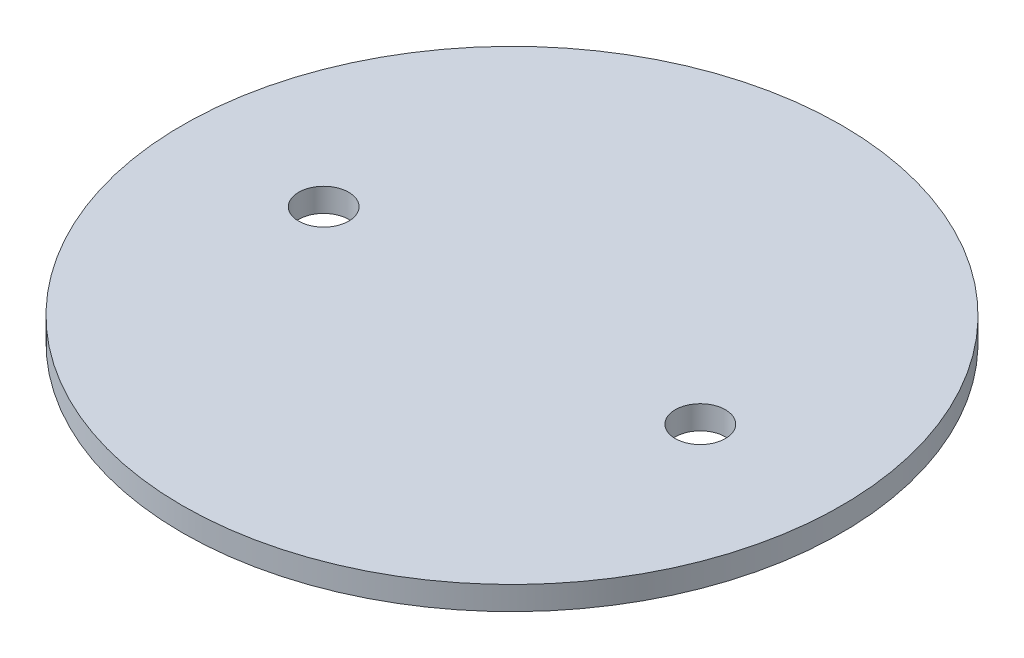
ISO-10303-21;
HEADER;
FILE_DESCRIPTION(('STEP AP214'),'2;1');
FILE_NAME('part.step','',(''),(''),'','','');
FILE_SCHEMA(('AUTOMOTIVE_DESIGN { 1 0 10303 214 1 1 1 1 }'));
ENDSEC;
DATA;
#1=APPLICATION_CONTEXT('core data for automotive mechanical design processes');
#2=APPLICATION_PROTOCOL_DEFINITION('international standard','automotive_design',2000,#1);
#3=PRODUCT_CONTEXT('',#1,'mechanical');
#4=PRODUCT('Part','Part','',(#3));
#5=PRODUCT_RELATED_PRODUCT_CATEGORY('part','',(#4));
#6=PRODUCT_DEFINITION_FORMATION('','',#4);
#7=PRODUCT_DEFINITION_CONTEXT('part definition',#1,'design');
#8=PRODUCT_DEFINITION('design','',#6,#7);
#9=PRODUCT_DEFINITION_SHAPE('','',#8);
#10=(LENGTH_UNIT() NAMED_UNIT(*) SI_UNIT(.MILLI.,.METRE.));
#11=(NAMED_UNIT(*) PLANE_ANGLE_UNIT() SI_UNIT($,.RADIAN.));
#12=(NAMED_UNIT(*) SI_UNIT($,.STERADIAN.) SOLID_ANGLE_UNIT());
#13=UNCERTAINTY_MEASURE_WITH_UNIT(LENGTH_MEASURE(1.E-05),#10,'distance_accuracy_value','');
#14=(GEOMETRIC_REPRESENTATION_CONTEXT(3) GLOBAL_UNCERTAINTY_ASSIGNED_CONTEXT((#13)) GLOBAL_UNIT_ASSIGNED_CONTEXT((#10,
#11,#12)) REPRESENTATION_CONTEXT('',''));
#15=CARTESIAN_POINT('',(0.,0.,0.));
#16=DIRECTION('',(0.,0.,1.));
#17=DIRECTION('',(1.,0.,0.));
#18=AXIS2_PLACEMENT_3D('',#15,#16,#17);
#19=CARTESIAN_POINT('',(0.,1.5875,0.));
#20=DIRECTION('',(0.,-1.,0.));
#21=DIRECTION('',(0.,0.,-1.));
#22=AXIS2_PLACEMENT_3D('',#19,#20,#21);
#23=CYLINDRICAL_SURFACE('',#22,44.45);
#24=CARTESIAN_POINT('',(0.,1.5875,0.));
#25=DIRECTION('',(0.,1.,0.));
#26=DIRECTION('',(0.,0.,1.));
#27=AXIS2_PLACEMENT_3D('',#24,#25,#26);
#28=CIRCLE('',#27,44.45);
#29=CARTESIAN_POINT('',(0.,1.5875,44.45));
#30=VERTEX_POINT('',#29);
#31=EDGE_CURVE('E10',#30,#30,#28,.T.);
#32=ORIENTED_EDGE('',*,*,#31,.F.);
#33=EDGE_LOOP('',(#32));
#34=FACE_BOUND('',#33,.T.);
#35=CARTESIAN_POINT('',(0.,-1.5875,0.));
#36=DIRECTION('',(0.,1.,0.));
#37=DIRECTION('',(0.,0.,1.));
#38=AXIS2_PLACEMENT_3D('',#35,#36,#37);
#39=CIRCLE('',#38,44.45);
#40=CARTESIAN_POINT('',(0.,-1.5875,44.45));
#41=VERTEX_POINT('',#40);
#42=EDGE_CURVE('E46',#41,#41,#39,.T.);
#43=ORIENTED_EDGE('',*,*,#42,.T.);
#44=EDGE_LOOP('',(#43));
#45=FACE_BOUND('',#44,.T.);
#46=ADVANCED_FACE('F43',(#34,#45),#23,.T.);
#47=CARTESIAN_POINT('',(0.,1.5875,0.));
#48=DIRECTION('',(0.,1.,0.));
#49=DIRECTION('',(0.,0.,1.));
#50=AXIS2_PLACEMENT_3D('',#47,#48,#49);
#51=PLANE('',#50);
#52=CARTESIAN_POINT('',(-25.4,1.5875,0.));
#53=DIRECTION('',(0.,1.,0.));
#54=DIRECTION('',(0.,0.,1.));
#55=AXIS2_PLACEMENT_3D('',#52,#53,#54);
#56=CIRCLE('',#55,3.37819999999999);
#57=CARTESIAN_POINT('',(-25.4,1.5875,3.37819999999999));
#58=VERTEX_POINT('',#57);
#59=EDGE_CURVE('E68',#58,#58,#56,.T.);
#60=ORIENTED_EDGE('',*,*,#59,.F.);
#61=EDGE_LOOP('',(#60));
#62=FACE_BOUND('',#61,.T.);
#63=CARTESIAN_POINT('',(25.4,1.5875,0.));
#64=DIRECTION('',(0.,1.,0.));
#65=DIRECTION('',(0.,0.,1.));
#66=AXIS2_PLACEMENT_3D('',#63,#64,#65);
#67=CIRCLE('',#66,3.37819999999999);
#68=CARTESIAN_POINT('',(25.4,1.5875,3.37819999999998));
#69=VERTEX_POINT('',#68);
#70=EDGE_CURVE('E60',#69,#69,#67,.T.);
#71=ORIENTED_EDGE('',*,*,#70,.F.);
#72=EDGE_LOOP('',(#71));
#73=FACE_BOUND('',#72,.T.);
#74=ORIENTED_EDGE('',*,*,#31,.T.);
#75=EDGE_LOOP('',(#74));
#76=FACE_BOUND('',#75,.T.);
#77=ADVANCED_FACE('F75',(#62,#73,#76),#51,.T.);
#78=CARTESIAN_POINT('',(0.,-1.5875,0.));
#79=DIRECTION('',(0.,1.,0.));
#80=DIRECTION('',(0.,0.,1.));
#81=AXIS2_PLACEMENT_3D('',#78,#79,#80);
#82=PLANE('',#81);
#83=CARTESIAN_POINT('',(-25.4,-1.5875,0.));
#84=DIRECTION('',(0.,1.,0.));
#85=DIRECTION('',(0.,0.,1.));
#86=AXIS2_PLACEMENT_3D('',#83,#84,#85);
#87=CIRCLE('',#86,3.37819999999999);
#88=CARTESIAN_POINT('',(-25.4,-1.5875,3.37819999999999));
#89=VERTEX_POINT('',#88);
#90=EDGE_CURVE('E64',#89,#89,#87,.T.);
#91=ORIENTED_EDGE('',*,*,#90,.T.);
#92=EDGE_LOOP('',(#91));
#93=FACE_BOUND('',#92,.T.);
#94=CARTESIAN_POINT('',(25.4,-1.5875,0.));
#95=DIRECTION('',(0.,1.,0.));
#96=DIRECTION('',(0.,0.,1.));
#97=AXIS2_PLACEMENT_3D('',#94,#95,#96);
#98=CIRCLE('',#97,3.37819999999999);
#99=CARTESIAN_POINT('',(25.4,-1.5875,3.37819999999998));
#100=VERTEX_POINT('',#99);
#101=EDGE_CURVE('E55',#100,#100,#98,.T.);
#102=ORIENTED_EDGE('',*,*,#101,.T.);
#103=EDGE_LOOP('',(#102));
#104=FACE_BOUND('',#103,.T.);
#105=ORIENTED_EDGE('',*,*,#42,.F.);
#106=EDGE_LOOP('',(#105));
#107=FACE_BOUND('',#106,.T.);
#108=ADVANCED_FACE('F78',(#93,#104,#107),#82,.F.);
#109=CARTESIAN_POINT('',(25.4,1.5875,0.));
#110=DIRECTION('',(0.,1.,0.));
#111=DIRECTION('',(0.,0.,1.));
#112=AXIS2_PLACEMENT_3D('',#109,#110,#111);
#113=CYLINDRICAL_SURFACE('',#112,3.37819999999999);
#114=ORIENTED_EDGE('',*,*,#101,.F.);
#115=EDGE_LOOP('',(#114));
#116=FACE_BOUND('',#115,.T.);
#117=ORIENTED_EDGE('',*,*,#70,.T.);
#118=EDGE_LOOP('',(#117));
#119=FACE_BOUND('',#118,.T.);
#120=ADVANCED_FACE('F82',(#116,#119),#113,.F.);
#121=CARTESIAN_POINT('',(-25.4,1.5875,0.));
#122=DIRECTION('',(0.,1.,0.));
#123=DIRECTION('',(0.,0.,1.));
#124=AXIS2_PLACEMENT_3D('',#121,#122,#123);
#125=CYLINDRICAL_SURFACE('',#124,3.37819999999999);
#126=ORIENTED_EDGE('',*,*,#90,.F.);
#127=EDGE_LOOP('',(#126));
#128=FACE_BOUND('',#127,.T.);
#129=ORIENTED_EDGE('',*,*,#59,.T.);
#130=EDGE_LOOP('',(#129));
#131=FACE_BOUND('',#130,.T.);
#132=ADVANCED_FACE('F73',(#128,#131),#125,.F.);
#133=CLOSED_SHELL('',(#46,#77,#108,#120,#132));
#134=MANIFOLD_SOLID_BREP('B2',#133);
#135=ADVANCED_BREP_SHAPE_REPRESENTATION('',(#18,#134),#14);
#136=SHAPE_DEFINITION_REPRESENTATION(#9,#135);
ENDSEC;
END-ISO-10303-21;
